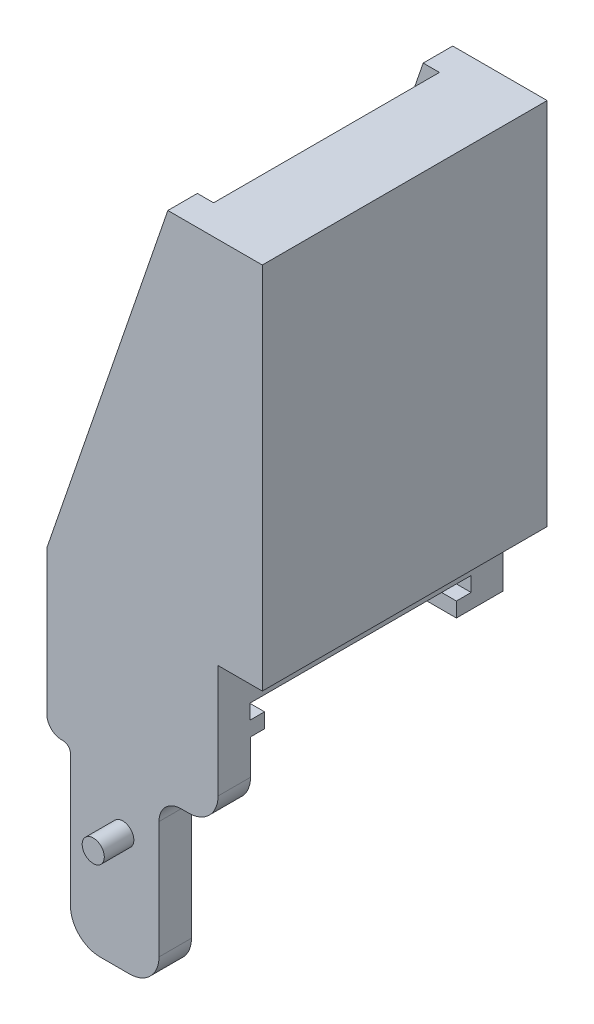
ISO-10303-21;
HEADER;
FILE_DESCRIPTION(('STEP AP214'),'2;1');
FILE_NAME('part.step','',(''),(''),'','','');
FILE_SCHEMA(('AUTOMOTIVE_DESIGN { 1 0 10303 214 1 1 1 1 }'));
ENDSEC;
DATA;
#1=APPLICATION_CONTEXT('core data for automotive mechanical design processes');
#2=APPLICATION_PROTOCOL_DEFINITION('international standard','automotive_design',2000,#1);
#3=PRODUCT_CONTEXT('',#1,'mechanical');
#4=PRODUCT('Part','Part','',(#3));
#5=PRODUCT_RELATED_PRODUCT_CATEGORY('part','',(#4));
#6=PRODUCT_DEFINITION_FORMATION('','',#4);
#7=PRODUCT_DEFINITION_CONTEXT('part definition',#1,'design');
#8=PRODUCT_DEFINITION('design','',#6,#7);
#9=PRODUCT_DEFINITION_SHAPE('','',#8);
#10=(LENGTH_UNIT() NAMED_UNIT(*) SI_UNIT(.MILLI.,.METRE.));
#11=(NAMED_UNIT(*) PLANE_ANGLE_UNIT() SI_UNIT($,.RADIAN.));
#12=(NAMED_UNIT(*) SI_UNIT($,.STERADIAN.) SOLID_ANGLE_UNIT());
#13=UNCERTAINTY_MEASURE_WITH_UNIT(LENGTH_MEASURE(1.E-05),#10,'distance_accuracy_value','');
#14=(GEOMETRIC_REPRESENTATION_CONTEXT(3) GLOBAL_UNCERTAINTY_ASSIGNED_CONTEXT((#13)) GLOBAL_UNIT_ASSIGNED_CONTEXT((#10,
#11,#12)) REPRESENTATION_CONTEXT('',''));
#15=CARTESIAN_POINT('',(0.,0.,0.));
#16=DIRECTION('',(0.,0.,1.));
#17=DIRECTION('',(1.,0.,0.));
#18=AXIS2_PLACEMENT_3D('',#15,#16,#17);
#19=CARTESIAN_POINT('',(5.79999999999999,-9.60695568829756,19.3));
#20=DIRECTION('',(-1.,0.,0.));
#21=DIRECTION('',(0.,0.,1.));
#22=AXIS2_PLACEMENT_3D('',#19,#20,#21);
#23=PLANE('',#22);
#24=DIRECTION('',(0.,0.,-1.));
#25=VECTOR('',#24,1.);
#26=CARTESIAN_POINT('',(5.79999999999999,-1.95,19.3));
#27=LINE('',#26,#25);
#28=CARTESIAN_POINT('',(5.79999999999999,-1.95,19.3));
#29=VERTEX_POINT('',#28);
#30=CARTESIAN_POINT('',(5.79999999999999,-1.95,0.));
#31=VERTEX_POINT('',#30);
#32=EDGE_CURVE('E47',#29,#31,#27,.T.);
#33=ORIENTED_EDGE('',*,*,#32,.F.);
#34=DIRECTION('',(0.,1.,0.));
#35=VECTOR('',#34,1.);
#36=CARTESIAN_POINT('',(5.79999999999999,-9.60695568829756,19.3));
#37=LINE('',#36,#35);
#38=CARTESIAN_POINT('',(5.79999999999999,-9.60695568829756,19.3));
#39=VERTEX_POINT('',#38);
#40=EDGE_CURVE('E263',#39,#29,#37,.T.);
#41=ORIENTED_EDGE('',*,*,#40,.F.);
#42=DIRECTION('',(0.,0.,-1.));
#43=VECTOR('',#42,1.);
#44=CARTESIAN_POINT('',(5.79999999999999,-9.60695568829756,19.3));
#45=LINE('',#44,#43);
#46=CARTESIAN_POINT('',(5.79999999999999,-9.60695568829757,17.1));
#47=VERTEX_POINT('',#46);
#48=EDGE_CURVE('E492',#39,#47,#45,.T.);
#49=ORIENTED_EDGE('',*,*,#48,.T.);
#50=DIRECTION('',(0.,1.,0.));
#51=VECTOR('',#50,1.);
#52=CARTESIAN_POINT('',(5.79999999999999,-9.60695568829756,17.1));
#53=LINE('',#52,#51);
#54=CARTESIAN_POINT('',(5.79999999999999,-7.239890456594,17.1));
#55=VERTEX_POINT('',#54);
#56=EDGE_CURVE('E353',#47,#55,#53,.T.);
#57=ORIENTED_EDGE('',*,*,#56,.T.);
#58=DIRECTION('',(0.,0.,-1.));
#59=VECTOR('',#58,1.);
#60=CARTESIAN_POINT('',(5.79999999999999,-7.239890456594,19.3));
#61=LINE('',#60,#59);
#62=CARTESIAN_POINT('',(5.79999999999999,-7.239890456594,16.15));
#63=VERTEX_POINT('',#62);
#64=EDGE_CURVE('E371',#55,#63,#61,.T.);
#65=ORIENTED_EDGE('',*,*,#64,.T.);
#66=DIRECTION('',(0.,1.,0.));
#67=VECTOR('',#66,1.);
#68=CARTESIAN_POINT('',(5.79999999999999,-9.60695568829756,16.15));
#69=LINE('',#68,#67);
#70=CARTESIAN_POINT('',(5.79999999999999,-6.239890456594,16.15));
#71=VERTEX_POINT('',#70);
#72=EDGE_CURVE('E374',#63,#71,#69,.T.);
#73=ORIENTED_EDGE('',*,*,#72,.T.);
#74=DIRECTION('',(0.,0.,1.));
#75=VECTOR('',#74,1.);
#76=CARTESIAN_POINT('',(5.79999999999999,-6.239890456594,19.3));
#77=LINE('',#76,#75);
#78=CARTESIAN_POINT('',(5.79999999999999,-6.239890456594,17.15));
#79=VERTEX_POINT('',#78);
#80=EDGE_CURVE('E377',#71,#79,#77,.T.);
#81=ORIENTED_EDGE('',*,*,#80,.T.);
#82=DIRECTION('',(0.,1.,0.));
#83=VECTOR('',#82,1.);
#84=CARTESIAN_POINT('',(5.79999999999999,-9.60695568829756,17.15));
#85=LINE('',#84,#83);
#86=CARTESIAN_POINT('',(5.79999999999999,-5.239890456594,17.15));
#87=VERTEX_POINT('',#86);
#88=EDGE_CURVE('E356',#79,#87,#85,.T.);
#89=ORIENTED_EDGE('',*,*,#88,.T.);
#90=DIRECTION('',(0.,0.,-1.));
#91=VECTOR('',#90,1.);
#92=CARTESIAN_POINT('',(5.79999999999999,-5.239890456594,19.3));
#93=LINE('',#92,#91);
#94=CARTESIAN_POINT('',(5.79999999999999,-5.239890456594,2.15));
#95=VERTEX_POINT('',#94);
#96=EDGE_CURVE('E359',#87,#95,#93,.T.);
#97=ORIENTED_EDGE('',*,*,#96,.T.);
#98=DIRECTION('',(0.,-1.,0.));
#99=VECTOR('',#98,1.);
#100=CARTESIAN_POINT('',(5.79999999999999,-9.60695568829756,2.15));
#101=LINE('',#100,#99);
#102=CARTESIAN_POINT('',(5.79999999999999,-6.239890456594,2.15));
#103=VERTEX_POINT('',#102);
#104=EDGE_CURVE('E362',#95,#103,#101,.T.);
#105=ORIENTED_EDGE('',*,*,#104,.T.);
#106=DIRECTION('',(0.,0.,1.));
#107=VECTOR('',#106,1.);
#108=CARTESIAN_POINT('',(5.79999999999999,-6.239890456594,19.3));
#109=LINE('',#108,#107);
#110=CARTESIAN_POINT('',(5.79999999999999,-6.239890456594,3.15));
#111=VERTEX_POINT('',#110);
#112=EDGE_CURVE('E365',#103,#111,#109,.T.);
#113=ORIENTED_EDGE('',*,*,#112,.T.);
#114=DIRECTION('',(0.,-1.,0.));
#115=VECTOR('',#114,1.);
#116=CARTESIAN_POINT('',(5.79999999999999,-9.60695568829756,3.15));
#117=LINE('',#116,#115);
#118=CARTESIAN_POINT('',(5.79999999999999,-7.239890456594,3.15));
#119=VERTEX_POINT('',#118);
#120=EDGE_CURVE('E368',#111,#119,#117,.T.);
#121=ORIENTED_EDGE('',*,*,#120,.T.);
#122=DIRECTION('',(0.,0.,-1.));
#123=VECTOR('',#122,1.);
#124=CARTESIAN_POINT('',(5.79999999999999,-7.239890456594,19.3));
#125=LINE('',#124,#123);
#126=CARTESIAN_POINT('',(5.79999999999999,-7.239890456594,0.));
#127=VERTEX_POINT('',#126);
#128=EDGE_CURVE('E306',#119,#127,#125,.T.);
#129=ORIENTED_EDGE('',*,*,#128,.T.);
#130=DIRECTION('',(0.,1.,0.));
#131=VECTOR('',#130,1.);
#132=CARTESIAN_POINT('',(5.79999999999999,-9.60695568829756,0.));
#133=LINE('',#132,#131);
#134=EDGE_CURVE('E52',#127,#31,#133,.T.);
#135=ORIENTED_EDGE('',*,*,#134,.T.);
#136=EDGE_LOOP('',(#33,#41,#49,#57,#65,#73,#81,#89,#97,#105,#113,#121,#129,#135));
#137=FACE_BOUND('',#136,.T.);
#138=ADVANCED_FACE('F32',(#137),#23,.F.);
#139=CARTESIAN_POINT('',(3.79999999999999,-9.60695568829757,19.3));
#140=DIRECTION('',(0.,0.,1.));
#141=DIRECTION('',(1.,0.,0.));
#142=AXIS2_PLACEMENT_3D('',#139,#140,#141);
#143=PLANE('',#142);
#144=CARTESIAN_POINT('',(3.79999999999999,-9.60695568829757,19.3));
#145=DIRECTION('',(0.,0.,1.));
#146=DIRECTION('',(1.,0.,0.));
#147=AXIS2_PLACEMENT_3D('',#144,#145,#146);
#148=CIRCLE('',#147,2.);
#149=CARTESIAN_POINT('',(3.79999999999998,-11.6069556882976,19.3));
#150=VERTEX_POINT('',#149);
#151=EDGE_CURVE('E412',#150,#39,#148,.T.);
#152=ORIENTED_EDGE('',*,*,#151,.T.);
#153=ORIENTED_EDGE('',*,*,#40,.T.);
#154=DIRECTION('',(-1.,0.,0.));
#155=VECTOR('',#154,1.);
#156=CARTESIAN_POINT('',(8.79999999999999,-1.95,19.3));
#157=LINE('',#156,#155);
#158=CARTESIAN_POINT('',(8.79999999999999,-1.95,19.3));
#159=VERTEX_POINT('',#158);
#160=EDGE_CURVE('E244',#159,#29,#157,.T.);
#161=ORIENTED_EDGE('',*,*,#160,.F.);
#162=DIRECTION('',(0.,-1.,0.));
#163=VECTOR('',#162,1.);
#164=CARTESIAN_POINT('',(8.79999999999999,23.05,19.3));
#165=LINE('',#164,#163);
#166=CARTESIAN_POINT('',(8.79999999999999,23.05,19.3));
#167=VERTEX_POINT('',#166);
#168=EDGE_CURVE('E251',#167,#159,#165,.T.);
#169=ORIENTED_EDGE('',*,*,#168,.F.);
#170=DIRECTION('',(-1.,0.,0.));
#171=VECTOR('',#170,1.);
#172=CARTESIAN_POINT('',(5.79999999999999,23.05,19.3));
#173=LINE('',#172,#171);
#174=CARTESIAN_POINT('',(2.4,23.05,19.3));
#175=VERTEX_POINT('',#174);
#176=EDGE_CURVE('E416',#167,#175,#173,.T.);
#177=ORIENTED_EDGE('',*,*,#176,.T.);
#178=DIRECTION('',(-0.324526679920324,-0.945876542694601,0.));
#179=VECTOR('',#178,1.);
#180=CARTESIAN_POINT('',(2.4,23.05,19.3));
#181=LINE('',#180,#179);
#182=CARTESIAN_POINT('',(-5.80000000000001,-0.850000000000011,19.3));
#183=VERTEX_POINT('',#182);
#184=EDGE_CURVE('E418',#175,#183,#181,.T.);
#185=ORIENTED_EDGE('',*,*,#184,.T.);
#186=DIRECTION('',(0.,-1.,0.));
#187=VECTOR('',#186,1.);
#188=CARTESIAN_POINT('',(-5.80000000000003,-10.609737320816,19.3));
#189=LINE('',#188,#187);
#190=CARTESIAN_POINT('',(-5.80000000000002,-10.609737320816,19.3));
#191=VERTEX_POINT('',#190);
#192=EDGE_CURVE('E420',#183,#191,#189,.T.);
#193=ORIENTED_EDGE('',*,*,#192,.T.);
#194=CARTESIAN_POINT('',(-4.80000000000001,-10.609737320816,19.3));
#195=DIRECTION('',(0.,0.,1.));
#196=DIRECTION('',(-1.,0.,0.));
#197=AXIS2_PLACEMENT_3D('',#194,#195,#196);
#198=CIRCLE('',#197,1.00000000000001);
#199=CARTESIAN_POINT('',(-4.79534594572987,-11.6097264906468,19.3));
#200=VERTEX_POINT('',#199);
#201=EDGE_CURVE('E422',#191,#200,#198,.T.);
#202=ORIENTED_EDGE('',*,*,#201,.T.);
#203=DIRECTION('',(0.999989169830779,0.00465405427015842,0.));
#204=VECTOR('',#203,1.);
#205=CARTESIAN_POINT('',(-4.70232702713509,-11.6092935708629,19.3));
#206=LINE('',#205,#204);
#207=CARTESIAN_POINT('',(-4.70232702713509,-11.6092935708629,19.3));
#208=VERTEX_POINT('',#207);
#209=EDGE_CURVE('E424',#200,#208,#206,.T.);
#210=ORIENTED_EDGE('',*,*,#209,.T.);
#211=CARTESIAN_POINT('',(-4.70000000000001,-12.1092881557783,19.3));
#212=DIRECTION('',(0.,0.,-1.));
#213=DIRECTION('',(1.,0.,0.));
#214=AXIS2_PLACEMENT_3D('',#211,#212,#213);
#215=CIRCLE('',#214,0.499999999999999);
#216=CARTESIAN_POINT('',(-4.20000000000001,-12.1092881557783,19.3));
#217=VERTEX_POINT('',#216);
#218=EDGE_CURVE('E426',#208,#217,#215,.T.);
#219=ORIENTED_EDGE('',*,*,#218,.T.);
#220=DIRECTION('',(0.,-1.,0.));
#221=VECTOR('',#220,1.);
#222=CARTESIAN_POINT('',(-4.20000000000001,-21.05,19.3));
#223=LINE('',#222,#221);
#224=CARTESIAN_POINT('',(-4.20000000000001,-21.05,19.3));
#225=VERTEX_POINT('',#224);
#226=EDGE_CURVE('E428',#217,#225,#223,.T.);
#227=ORIENTED_EDGE('',*,*,#226,.T.);
#228=CARTESIAN_POINT('',(-2.20000000000001,-21.05,19.3));
#229=DIRECTION('',(0.,0.,1.));
#230=DIRECTION('',(-1.,0.,0.));
#231=AXIS2_PLACEMENT_3D('',#228,#229,#230);
#232=CIRCLE('',#231,2.);
#233=CARTESIAN_POINT('',(-2.19999999999999,-23.05,19.3));
#234=VERTEX_POINT('',#233);
#235=EDGE_CURVE('E430',#225,#234,#232,.T.);
#236=ORIENTED_EDGE('',*,*,#235,.T.);
#237=DIRECTION('',(1.,0.,0.));
#238=VECTOR('',#237,1.);
#239=CARTESIAN_POINT('',(-0.200000000000023,-23.05,19.3));
#240=LINE('',#239,#238);
#241=CARTESIAN_POINT('',(-0.200000000000022,-23.05,19.3));
#242=VERTEX_POINT('',#241);
#243=EDGE_CURVE('E432',#234,#242,#240,.T.);
#244=ORIENTED_EDGE('',*,*,#243,.T.);
#245=CARTESIAN_POINT('',(-0.200000000000008,-21.05,19.3));
#246=DIRECTION('',(0.,0.,1.));
#247=DIRECTION('',(-1.,0.,0.));
#248=AXIS2_PLACEMENT_3D('',#245,#246,#247);
#249=CIRCLE('',#248,2.);
#250=CARTESIAN_POINT('',(1.79999999999999,-21.05,19.3));
#251=VERTEX_POINT('',#250);
#252=EDGE_CURVE('E434',#242,#251,#249,.T.);
#253=ORIENTED_EDGE('',*,*,#252,.T.);
#254=DIRECTION('',(0.,1.,0.));
#255=VECTOR('',#254,1.);
#256=CARTESIAN_POINT('',(1.79999999999999,-13.1069556882976,19.3));
#257=LINE('',#256,#255);
#258=CARTESIAN_POINT('',(1.79999999999999,-13.1069556882976,19.3));
#259=VERTEX_POINT('',#258);
#260=EDGE_CURVE('E436',#251,#259,#257,.T.);
#261=ORIENTED_EDGE('',*,*,#260,.T.);
#262=CARTESIAN_POINT('',(3.29999999999999,-13.1069556882976,19.3));
#263=DIRECTION('',(0.,0.,-1.));
#264=DIRECTION('',(-1.,0.,0.));
#265=AXIS2_PLACEMENT_3D('',#262,#263,#264);
#266=CIRCLE('',#265,1.5);
#267=CARTESIAN_POINT('',(3.3,-11.6069556882976,19.3));
#268=VERTEX_POINT('',#267);
#269=EDGE_CURVE('E438',#259,#268,#266,.T.);
#270=ORIENTED_EDGE('',*,*,#269,.T.);
#271=DIRECTION('',(1.,0.,0.));
#272=VECTOR('',#271,1.);
#273=CARTESIAN_POINT('',(3.3,-11.6069556882976,19.3));
#274=LINE('',#273,#272);
#275=EDGE_CURVE('E440',#268,#150,#274,.T.);
#276=ORIENTED_EDGE('',*,*,#275,.T.);
#277=EDGE_LOOP('',(#152,#153,#161,#169,#177,#185,#193,#202,#210,#219,#227,#236,#244,#253,#261,
#270,#276));
#278=FACE_BOUND('',#277,.T.);
#279=CARTESIAN_POINT('',(-0.655214383275673,-15.0462014414849,19.3));
#280=DIRECTION('',(0.,0.,1.));
#281=DIRECTION('',(1.,0.,0.));
#282=AXIS2_PLACEMENT_3D('',#279,#280,#281);
#283=CIRCLE('',#282,0.750000000000001);
#284=CARTESIAN_POINT('',(0.0947856167243282,-15.0462014414849,19.3));
#285=VERTEX_POINT('',#284);
#286=EDGE_CURVE('E264',#285,#285,#283,.T.);
#287=ORIENTED_EDGE('',*,*,#286,.F.);
#288=EDGE_LOOP('',(#287));
#289=FACE_BOUND('',#288,.T.);
#290=ADVANCED_FACE('F261',(#278,#289),#143,.T.);
#291=CARTESIAN_POINT('',(2.4,23.05,19.3));
#292=DIRECTION('',(0.945876542694601,-0.324526679920324,0.));
#293=DIRECTION('',(0.324526679920324,0.945876542694601,0.));
#294=AXIS2_PLACEMENT_3D('',#291,#292,#293);
#295=PLANE('',#294);
#296=DIRECTION('',(0.,0.,-1.));
#297=VECTOR('',#296,1.);
#298=CARTESIAN_POINT('',(-5.80000000000001,-0.850000000000011,19.3));
#299=LINE('',#298,#297);
#300=CARTESIAN_POINT('',(-5.8,-0.850000000000011,2.));
#301=VERTEX_POINT('',#300);
#302=CARTESIAN_POINT('',(-5.80000000000001,-0.850000000000011,0.));
#303=VERTEX_POINT('',#302);
#304=EDGE_CURVE('E484',#301,#303,#299,.T.);
#305=ORIENTED_EDGE('',*,*,#304,.F.);
#306=DIRECTION('',(0.324526679920324,0.945876542694601,0.));
#307=VECTOR('',#306,1.);
#308=CARTESIAN_POINT('',(2.4,23.05,2.));
#309=LINE('',#308,#307);
#310=CARTESIAN_POINT('',(2.4,23.05,2.));
#311=VERTEX_POINT('',#310);
#312=EDGE_CURVE('E409',#301,#311,#309,.T.);
#313=ORIENTED_EDGE('',*,*,#312,.T.);
#314=DIRECTION('',(0.,0.,-1.));
#315=VECTOR('',#314,1.);
#316=CARTESIAN_POINT('',(2.4,23.05,19.3));
#317=LINE('',#316,#315);
#318=CARTESIAN_POINT('',(2.4,23.05,0.));
#319=VERTEX_POINT('',#318);
#320=EDGE_CURVE('E488',#311,#319,#317,.T.);
#321=ORIENTED_EDGE('',*,*,#320,.T.);
#322=DIRECTION('',(-0.324526679920324,-0.945876542694601,0.));
#323=VECTOR('',#322,1.);
#324=CARTESIAN_POINT('',(2.4,23.05,0.));
#325=LINE('',#324,#323);
#326=EDGE_CURVE('E447',#319,#303,#325,.T.);
#327=ORIENTED_EDGE('',*,*,#326,.T.);
#328=EDGE_LOOP('',(#305,#313,#321,#327));
#329=FACE_BOUND('',#328,.T.);
#330=ADVANCED_FACE('F511',(#329),#295,.F.);
#331=CARTESIAN_POINT('',(3.79999999999999,-9.60695568829757,19.3));
#332=DIRECTION('',(0.,0.,-1.));
#333=DIRECTION('',(-1.,0.,0.));
#334=AXIS2_PLACEMENT_3D('',#331,#332,#333);
#335=CYLINDRICAL_SURFACE('',#334,2.);
#336=DIRECTION('',(0.,0.,-1.));
#337=VECTOR('',#336,1.);
#338=CARTESIAN_POINT('',(3.79999999999998,-11.6069556882976,19.3));
#339=LINE('',#338,#337);
#340=CARTESIAN_POINT('',(3.79999999999998,-11.6069556882976,17.1));
#341=VERTEX_POINT('',#340);
#342=EDGE_CURVE('E442',#150,#341,#339,.T.);
#343=ORIENTED_EDGE('',*,*,#342,.T.);
#344=CARTESIAN_POINT('',(3.79999999999999,-9.60695568829757,17.1));
#345=DIRECTION('',(0.,0.,1.));
#346=DIRECTION('',(1.,0.,0.));
#347=AXIS2_PLACEMENT_3D('',#344,#345,#346);
#348=CIRCLE('',#347,2.);
#349=EDGE_CURVE('E350',#341,#47,#348,.T.);
#350=ORIENTED_EDGE('',*,*,#349,.T.);
#351=ORIENTED_EDGE('',*,*,#48,.F.);
#352=ORIENTED_EDGE('',*,*,#151,.F.);
#353=EDGE_LOOP('',(#343,#350,#351,#352));
#354=FACE_BOUND('',#353,.T.);
#355=ADVANCED_FACE('F34',(#354),#335,.T.);
#356=CARTESIAN_POINT('',(5.79999999999999,23.05,19.3));
#357=DIRECTION('',(0.,-1.,0.));
#358=DIRECTION('',(1.,0.,0.));
#359=AXIS2_PLACEMENT_3D('',#356,#357,#358);
#360=PLANE('',#359);
#361=ORIENTED_EDGE('',*,*,#320,.F.);
#362=DIRECTION('',(-1.,0.,0.));
#363=VECTOR('',#362,1.);
#364=CARTESIAN_POINT('',(3.5,23.05,2.));
#365=LINE('',#364,#363);
#366=CARTESIAN_POINT('',(3.5,23.05,2.));
#367=VERTEX_POINT('',#366);
#368=EDGE_CURVE('E400',#367,#311,#365,.T.);
#369=ORIENTED_EDGE('',*,*,#368,.F.);
#370=DIRECTION('',(0.,0.,-1.));
#371=VECTOR('',#370,1.);
#372=CARTESIAN_POINT('',(3.5,23.05,17.3));
#373=LINE('',#372,#371);
#374=CARTESIAN_POINT('',(3.5,23.05,17.3));
#375=VERTEX_POINT('',#374);
#376=EDGE_CURVE('E388',#375,#367,#373,.T.);
#377=ORIENTED_EDGE('',*,*,#376,.F.);
#378=DIRECTION('',(-1.,0.,0.));
#379=VECTOR('',#378,1.);
#380=CARTESIAN_POINT('',(3.5,23.05,17.3));
#381=LINE('',#380,#379);
#382=CARTESIAN_POINT('',(2.4,23.05,17.3));
#383=VERTEX_POINT('',#382);
#384=EDGE_CURVE('E402',#375,#383,#381,.T.);
#385=ORIENTED_EDGE('',*,*,#384,.T.);
#386=EDGE_CURVE('E489',#175,#383,#317,.T.);
#387=ORIENTED_EDGE('',*,*,#386,.F.);
#388=ORIENTED_EDGE('',*,*,#176,.F.);
#389=DIRECTION('',(0.,0.,1.));
#390=VECTOR('',#389,1.);
#391=CARTESIAN_POINT('',(8.79999999999999,23.05,19.3));
#392=LINE('',#391,#390);
#393=CARTESIAN_POINT('',(8.79999999999999,23.05,0.));
#394=VERTEX_POINT('',#393);
#395=EDGE_CURVE('E257',#394,#167,#392,.T.);
#396=ORIENTED_EDGE('',*,*,#395,.F.);
#397=DIRECTION('',(-1.,0.,0.));
#398=VECTOR('',#397,1.);
#399=CARTESIAN_POINT('',(5.79999999999999,23.05,0.));
#400=LINE('',#399,#398);
#401=EDGE_CURVE('E444',#394,#319,#400,.T.);
#402=ORIENTED_EDGE('',*,*,#401,.T.);
#403=EDGE_LOOP('',(#361,#369,#377,#385,#387,#388,#396,#402));
#404=FACE_BOUND('',#403,.T.);
#405=ADVANCED_FACE('F515',(#404),#360,.F.);
#406=ORIENTED_EDGE('',*,*,#386,.T.);
#407=DIRECTION('',(-0.324526679920324,-0.945876542694601,0.));
#408=VECTOR('',#407,1.);
#409=CARTESIAN_POINT('',(2.4,23.05,17.3));
#410=LINE('',#409,#408);
#411=CARTESIAN_POINT('',(-5.8,-0.850000000000011,17.3));
#412=VERTEX_POINT('',#411);
#413=EDGE_CURVE('E399',#383,#412,#410,.T.);
#414=ORIENTED_EDGE('',*,*,#413,.T.);
#415=EDGE_CURVE('E485',#183,#412,#299,.T.);
#416=ORIENTED_EDGE('',*,*,#415,.F.);
#417=ORIENTED_EDGE('',*,*,#184,.F.);
#418=EDGE_LOOP('',(#406,#414,#416,#417));
#419=FACE_BOUND('',#418,.T.);
#420=ADVANCED_FACE('F523',(#419),#295,.F.);
#421=CARTESIAN_POINT('',(-5.80000000000003,-10.609737320816,19.3));
#422=DIRECTION('',(1.,0.,0.));
#423=DIRECTION('',(0.,1.,0.));
#424=AXIS2_PLACEMENT_3D('',#421,#422,#423);
#425=PLANE('',#424);
#426=DIRECTION('',(0.,0.,-1.));
#427=VECTOR('',#426,1.);
#428=CARTESIAN_POINT('',(-5.80000000000002,-7.23989045659397,16.15));
#429=LINE('',#428,#427);
#430=CARTESIAN_POINT('',(-5.80000000000002,-7.23989045659397,17.1));
#431=VERTEX_POINT('',#430);
#432=CARTESIAN_POINT('',(-5.80000000000002,-7.23989045659397,16.15));
#433=VERTEX_POINT('',#432);
#434=EDGE_CURVE('E297',#431,#433,#429,.T.);
#435=ORIENTED_EDGE('',*,*,#434,.F.);
#436=DIRECTION('',(0.,1.,0.));
#437=VECTOR('',#436,1.);
#438=CARTESIAN_POINT('',(-5.80000000000002,-7.23989045659397,17.1));
#439=LINE('',#438,#437);
#440=CARTESIAN_POINT('',(-5.80000000000003,-10.609737320816,17.1));
#441=VERTEX_POINT('',#440);
#442=EDGE_CURVE('E294',#441,#431,#439,.T.);
#443=ORIENTED_EDGE('',*,*,#442,.F.);
#444=DIRECTION('',(0.,0.,-1.));
#445=VECTOR('',#444,1.);
#446=CARTESIAN_POINT('',(-5.80000000000002,-10.609737320816,19.3));
#447=LINE('',#446,#445);
#448=EDGE_CURVE('E481',#191,#441,#447,.T.);
#449=ORIENTED_EDGE('',*,*,#448,.F.);
#450=ORIENTED_EDGE('',*,*,#192,.F.);
#451=ORIENTED_EDGE('',*,*,#415,.T.);
#452=DIRECTION('',(0.,1.,0.));
#453=VECTOR('',#452,1.);
#454=CARTESIAN_POINT('',(-5.8,-3.25,17.3));
#455=LINE('',#454,#453);
#456=CARTESIAN_POINT('',(-5.80000000000001,-3.25,17.3));
#457=VERTEX_POINT('',#456);
#458=EDGE_CURVE('E385',#457,#412,#455,.T.);
#459=ORIENTED_EDGE('',*,*,#458,.F.);
#460=DIRECTION('',(0.,0.,1.));
#461=VECTOR('',#460,1.);
#462=CARTESIAN_POINT('',(-5.8,-3.25,2.));
#463=LINE('',#462,#461);
#464=CARTESIAN_POINT('',(-5.8,-3.25,2.));
#465=VERTEX_POINT('',#464);
#466=EDGE_CURVE('E380',#465,#457,#463,.T.);
#467=ORIENTED_EDGE('',*,*,#466,.F.);
#468=DIRECTION('',(0.,1.,0.));
#469=VECTOR('',#468,1.);
#470=CARTESIAN_POINT('',(-5.80000000000003,-10.609737320816,2.));
#471=LINE('',#470,#469);
#472=EDGE_CURVE('E495',#465,#301,#471,.T.);
#473=ORIENTED_EDGE('',*,*,#472,.T.);
#474=ORIENTED_EDGE('',*,*,#304,.T.);
#475=DIRECTION('',(0.,-1.,0.));
#476=VECTOR('',#475,1.);
#477=CARTESIAN_POINT('',(-5.80000000000003,-10.609737320816,0.));
#478=LINE('',#477,#476);
#479=CARTESIAN_POINT('',(-5.80000000000002,-7.23989045659397,0.));
#480=VERTEX_POINT('',#479);
#481=EDGE_CURVE('E414',#303,#480,#478,.T.);
#482=ORIENTED_EDGE('',*,*,#481,.T.);
#483=DIRECTION('',(0.,0.,-1.));
#484=VECTOR('',#483,1.);
#485=CARTESIAN_POINT('',(-5.80000000000002,-7.23989045659397,3.15));
#486=LINE('',#485,#484);
#487=CARTESIAN_POINT('',(-5.80000000000002,-7.23989045659397,3.15));
#488=VERTEX_POINT('',#487);
#489=EDGE_CURVE('E292',#488,#480,#486,.T.);
#490=ORIENTED_EDGE('',*,*,#489,.F.);
#491=DIRECTION('',(0.,-1.,0.));
#492=VECTOR('',#491,1.);
#493=CARTESIAN_POINT('',(-5.80000000000002,-6.23989045659397,3.15));
#494=LINE('',#493,#492);
#495=CARTESIAN_POINT('',(-5.80000000000002,-6.23989045659397,3.15));
#496=VERTEX_POINT('',#495);
#497=EDGE_CURVE('E289',#496,#488,#494,.T.);
#498=ORIENTED_EDGE('',*,*,#497,.F.);
#499=DIRECTION('',(0.,0.,1.));
#500=VECTOR('',#499,1.);
#501=CARTESIAN_POINT('',(-5.80000000000002,-6.23989045659397,2.15));
#502=LINE('',#501,#500);
#503=CARTESIAN_POINT('',(-5.80000000000002,-6.23989045659397,2.15));
#504=VERTEX_POINT('',#503);
#505=EDGE_CURVE('E286',#504,#496,#502,.T.);
#506=ORIENTED_EDGE('',*,*,#505,.F.);
#507=DIRECTION('',(0.,-1.,0.));
#508=VECTOR('',#507,1.);
#509=CARTESIAN_POINT('',(-5.80000000000002,-5.23989045659397,2.15));
#510=LINE('',#509,#508);
#511=CARTESIAN_POINT('',(-5.80000000000002,-5.23989045659397,2.15));
#512=VERTEX_POINT('',#511);
#513=EDGE_CURVE('E283',#512,#504,#510,.T.);
#514=ORIENTED_EDGE('',*,*,#513,.F.);
#515=DIRECTION('',(0.,0.,-1.));
#516=VECTOR('',#515,1.);
#517=CARTESIAN_POINT('',(-5.80000000000002,-5.23989045659397,17.15));
#518=LINE('',#517,#516);
#519=CARTESIAN_POINT('',(-5.80000000000002,-5.23989045659397,17.15));
#520=VERTEX_POINT('',#519);
#521=EDGE_CURVE('E280',#520,#512,#518,.T.);
#522=ORIENTED_EDGE('',*,*,#521,.F.);
#523=DIRECTION('',(0.,1.,0.));
#524=VECTOR('',#523,1.);
#525=CARTESIAN_POINT('',(-5.80000000000002,-5.23989045659397,17.15));
#526=LINE('',#525,#524);
#527=CARTESIAN_POINT('',(-5.80000000000002,-6.23989045659397,17.15));
#528=VERTEX_POINT('',#527);
#529=EDGE_CURVE('E277',#528,#520,#526,.T.);
#530=ORIENTED_EDGE('',*,*,#529,.F.);
#531=DIRECTION('',(0.,0.,1.));
#532=VECTOR('',#531,1.);
#533=CARTESIAN_POINT('',(-5.80000000000002,-6.23989045659397,17.15));
#534=LINE('',#533,#532);
#535=CARTESIAN_POINT('',(-5.80000000000002,-6.23989045659397,16.15));
#536=VERTEX_POINT('',#535);
#537=EDGE_CURVE('E273',#536,#528,#534,.T.);
#538=ORIENTED_EDGE('',*,*,#537,.F.);
#539=DIRECTION('',(0.,1.,0.));
#540=VECTOR('',#539,1.);
#541=CARTESIAN_POINT('',(-5.80000000000002,-6.23989045659397,16.15));
#542=LINE('',#541,#540);
#543=EDGE_CURVE('E300',#433,#536,#542,.T.);
#544=ORIENTED_EDGE('',*,*,#543,.F.);
#545=EDGE_LOOP('',(#435,#443,#449,#450,#451,#459,#467,#473,#474,#482,#490,#498,#506,#514,#522,
#530,#538,#544));
#546=FACE_BOUND('',#545,.T.);
#547=ADVANCED_FACE('F506',(#546),#425,.F.);
#548=CARTESIAN_POINT('',(-4.80000000000001,-10.609737320816,19.3));
#549=DIRECTION('',(0.,0.,-1.));
#550=DIRECTION('',(-1.,0.,0.));
#551=AXIS2_PLACEMENT_3D('',#548,#549,#550);
#552=CYLINDRICAL_SURFACE('',#551,1.00000000000001);
#553=ORIENTED_EDGE('',*,*,#448,.T.);
#554=CARTESIAN_POINT('',(-4.80000000000001,-10.609737320816,17.1));
#555=DIRECTION('',(0.,0.,1.));
#556=DIRECTION('',(1.,0.,0.));
#557=AXIS2_PLACEMENT_3D('',#554,#555,#556);
#558=CIRCLE('',#557,1.00000000000001);
#559=CARTESIAN_POINT('',(-4.79534594572987,-11.6097264906468,17.1));
#560=VERTEX_POINT('',#559);
#561=EDGE_CURVE('E347',#441,#560,#558,.T.);
#562=ORIENTED_EDGE('',*,*,#561,.T.);
#563=DIRECTION('',(0.,0.,-1.));
#564=VECTOR('',#563,1.);
#565=CARTESIAN_POINT('',(-4.79534594572987,-11.6097264906468,19.3));
#566=LINE('',#565,#564);
#567=EDGE_CURVE('E478',#200,#560,#566,.T.);
#568=ORIENTED_EDGE('',*,*,#567,.F.);
#569=ORIENTED_EDGE('',*,*,#201,.F.);
#570=EDGE_LOOP('',(#553,#562,#568,#569));
#571=FACE_BOUND('',#570,.T.);
#572=ADVANCED_FACE('F529',(#571),#552,.T.);
#573=CARTESIAN_POINT('',(-4.70232702713509,-11.6092935708629,19.3));
#574=DIRECTION('',(-0.00465405427015842,0.999989169830779,0.));
#575=DIRECTION('',(-0.999989169830779,-0.00465405427015842,0.));
#576=AXIS2_PLACEMENT_3D('',#573,#574,#575);
#577=PLANE('',#576);
#578=ORIENTED_EDGE('',*,*,#567,.T.);
#579=DIRECTION('',(0.999989169830779,0.00465405427015842,0.));
#580=VECTOR('',#579,1.);
#581=CARTESIAN_POINT('',(-4.70232702713509,-11.6092935708629,17.1));
#582=LINE('',#581,#580);
#583=CARTESIAN_POINT('',(-4.70232702713509,-11.6092935708629,17.1));
#584=VERTEX_POINT('',#583);
#585=EDGE_CURVE('E344',#560,#584,#582,.T.);
#586=ORIENTED_EDGE('',*,*,#585,.T.);
#587=DIRECTION('',(0.,0.,-1.));
#588=VECTOR('',#587,1.);
#589=CARTESIAN_POINT('',(-4.70232702713509,-11.6092935708629,19.3));
#590=LINE('',#589,#588);
#591=EDGE_CURVE('E475',#208,#584,#590,.T.);
#592=ORIENTED_EDGE('',*,*,#591,.F.);
#593=ORIENTED_EDGE('',*,*,#209,.F.);
#594=EDGE_LOOP('',(#578,#586,#592,#593));
#595=FACE_BOUND('',#594,.T.);
#596=ADVANCED_FACE('F535',(#595),#577,.F.);
#597=CARTESIAN_POINT('',(-4.70000000000001,-12.1092881557783,19.3));
#598=DIRECTION('',(0.,0.,-1.));
#599=DIRECTION('',(-1.,0.,0.));
#600=AXIS2_PLACEMENT_3D('',#597,#598,#599);
#601=CYLINDRICAL_SURFACE('',#600,0.499999999999999);
#602=ORIENTED_EDGE('',*,*,#591,.T.);
#603=CARTESIAN_POINT('',(-4.70000000000001,-12.1092881557783,17.1));
#604=DIRECTION('',(0.,0.,1.));
#605=DIRECTION('',(1.,0.,0.));
#606=AXIS2_PLACEMENT_3D('',#603,#604,#605);
#607=CIRCLE('',#606,0.499999999999999);
#608=CARTESIAN_POINT('',(-4.20000000000001,-12.1092881557783,17.1));
#609=VERTEX_POINT('',#608);
#610=EDGE_CURVE('E341',#584,#609,#607,.F.);
#611=ORIENTED_EDGE('',*,*,#610,.T.);
#612=DIRECTION('',(0.,0.,-1.));
#613=VECTOR('',#612,1.);
#614=CARTESIAN_POINT('',(-4.20000000000001,-12.1092881557783,19.3));
#615=LINE('',#614,#613);
#616=EDGE_CURVE('E472',#217,#609,#615,.T.);
#617=ORIENTED_EDGE('',*,*,#616,.F.);
#618=ORIENTED_EDGE('',*,*,#218,.F.);
#619=EDGE_LOOP('',(#602,#611,#617,#618));
#620=FACE_BOUND('',#619,.T.);
#621=ADVANCED_FACE('F537',(#620),#601,.F.);
#622=CARTESIAN_POINT('',(-4.20000000000001,-21.05,19.3));
#623=DIRECTION('',(1.,0.,0.));
#624=DIRECTION('',(0.,0.,-1.));
#625=AXIS2_PLACEMENT_3D('',#622,#623,#624);
#626=PLANE('',#625);
#627=ORIENTED_EDGE('',*,*,#616,.T.);
#628=DIRECTION('',(0.,-1.,0.));
#629=VECTOR('',#628,1.);
#630=CARTESIAN_POINT('',(-4.20000000000001,-21.05,17.1));
#631=LINE('',#630,#629);
#632=CARTESIAN_POINT('',(-4.20000000000001,-21.05,17.1));
#633=VERTEX_POINT('',#632);
#634=EDGE_CURVE('E338',#609,#633,#631,.T.);
#635=ORIENTED_EDGE('',*,*,#634,.T.);
#636=DIRECTION('',(0.,0.,-1.));
#637=VECTOR('',#636,1.);
#638=CARTESIAN_POINT('',(-4.20000000000001,-21.05,19.3));
#639=LINE('',#638,#637);
#640=EDGE_CURVE('E469',#225,#633,#639,.T.);
#641=ORIENTED_EDGE('',*,*,#640,.F.);
#642=ORIENTED_EDGE('',*,*,#226,.F.);
#643=EDGE_LOOP('',(#627,#635,#641,#642));
#644=FACE_BOUND('',#643,.T.);
#645=ADVANCED_FACE('F541',(#644),#626,.F.);
#646=CARTESIAN_POINT('',(-2.20000000000001,-21.05,19.3));
#647=DIRECTION('',(0.,0.,-1.));
#648=DIRECTION('',(-1.,0.,0.));
#649=AXIS2_PLACEMENT_3D('',#646,#647,#648);
#650=CYLINDRICAL_SURFACE('',#649,2.);
#651=ORIENTED_EDGE('',*,*,#640,.T.);
#652=CARTESIAN_POINT('',(-2.20000000000001,-21.05,17.1));
#653=DIRECTION('',(0.,0.,1.));
#654=DIRECTION('',(1.,0.,0.));
#655=AXIS2_PLACEMENT_3D('',#652,#653,#654);
#656=CIRCLE('',#655,2.);
#657=CARTESIAN_POINT('',(-2.19999999999999,-23.05,17.1));
#658=VERTEX_POINT('',#657);
#659=EDGE_CURVE('E335',#633,#658,#656,.T.);
#660=ORIENTED_EDGE('',*,*,#659,.T.);
#661=DIRECTION('',(0.,0.,-1.));
#662=VECTOR('',#661,1.);
#663=CARTESIAN_POINT('',(-2.19999999999999,-23.05,19.3));
#664=LINE('',#663,#662);
#665=EDGE_CURVE('E466',#234,#658,#664,.T.);
#666=ORIENTED_EDGE('',*,*,#665,.F.);
#667=ORIENTED_EDGE('',*,*,#235,.F.);
#668=EDGE_LOOP('',(#651,#660,#666,#667));
#669=FACE_BOUND('',#668,.T.);
#670=ADVANCED_FACE('F547',(#669),#650,.T.);
#671=CARTESIAN_POINT('',(-0.200000000000023,-23.05,19.3));
#672=DIRECTION('',(0.,1.,0.));
#673=DIRECTION('',(0.,0.,1.));
#674=AXIS2_PLACEMENT_3D('',#671,#672,#673);
#675=PLANE('',#674);
#676=ORIENTED_EDGE('',*,*,#665,.T.);
#677=DIRECTION('',(1.,0.,0.));
#678=VECTOR('',#677,1.);
#679=CARTESIAN_POINT('',(-0.200000000000023,-23.05,17.1));
#680=LINE('',#679,#678);
#681=CARTESIAN_POINT('',(-0.200000000000022,-23.05,17.1));
#682=VERTEX_POINT('',#681);
#683=EDGE_CURVE('E332',#658,#682,#680,.T.);
#684=ORIENTED_EDGE('',*,*,#683,.T.);
#685=DIRECTION('',(0.,0.,-1.));
#686=VECTOR('',#685,1.);
#687=CARTESIAN_POINT('',(-0.200000000000022,-23.05,19.3));
#688=LINE('',#687,#686);
#689=EDGE_CURVE('E463',#242,#682,#688,.T.);
#690=ORIENTED_EDGE('',*,*,#689,.F.);
#691=ORIENTED_EDGE('',*,*,#243,.F.);
#692=EDGE_LOOP('',(#676,#684,#690,#691));
#693=FACE_BOUND('',#692,.T.);
#694=ADVANCED_FACE('F549',(#693),#675,.F.);
#695=CARTESIAN_POINT('',(-0.200000000000008,-21.05,19.3));
#696=DIRECTION('',(0.,0.,-1.));
#697=DIRECTION('',(-1.,0.,0.));
#698=AXIS2_PLACEMENT_3D('',#695,#696,#697);
#699=CYLINDRICAL_SURFACE('',#698,2.);
#700=ORIENTED_EDGE('',*,*,#689,.T.);
#701=CARTESIAN_POINT('',(-0.200000000000008,-21.05,17.1));
#702=DIRECTION('',(0.,0.,1.));
#703=DIRECTION('',(1.,0.,0.));
#704=AXIS2_PLACEMENT_3D('',#701,#702,#703);
#705=CIRCLE('',#704,2.);
#706=CARTESIAN_POINT('',(1.79999999999999,-21.05,17.1));
#707=VERTEX_POINT('',#706);
#708=EDGE_CURVE('E329',#682,#707,#705,.T.);
#709=ORIENTED_EDGE('',*,*,#708,.T.);
#710=DIRECTION('',(0.,0.,-1.));
#711=VECTOR('',#710,1.);
#712=CARTESIAN_POINT('',(1.79999999999999,-21.05,19.3));
#713=LINE('',#712,#711);
#714=EDGE_CURVE('E460',#251,#707,#713,.T.);
#715=ORIENTED_EDGE('',*,*,#714,.F.);
#716=ORIENTED_EDGE('',*,*,#252,.F.);
#717=EDGE_LOOP('',(#700,#709,#715,#716));
#718=FACE_BOUND('',#717,.T.);
#719=ADVANCED_FACE('F553',(#718),#699,.T.);
#720=CARTESIAN_POINT('',(1.79999999999999,-13.1069556882976,19.3));
#721=DIRECTION('',(-1.,0.,0.));
#722=DIRECTION('',(0.,0.,1.));
#723=AXIS2_PLACEMENT_3D('',#720,#721,#722);
#724=PLANE('',#723);
#725=ORIENTED_EDGE('',*,*,#714,.T.);
#726=DIRECTION('',(0.,1.,0.));
#727=VECTOR('',#726,1.);
#728=CARTESIAN_POINT('',(1.79999999999999,-13.1069556882976,17.1));
#729=LINE('',#728,#727);
#730=CARTESIAN_POINT('',(1.79999999999999,-13.1069556882976,17.1));
#731=VERTEX_POINT('',#730);
#732=EDGE_CURVE('E326',#707,#731,#729,.T.);
#733=ORIENTED_EDGE('',*,*,#732,.T.);
#734=DIRECTION('',(0.,0.,-1.));
#735=VECTOR('',#734,1.);
#736=CARTESIAN_POINT('',(1.79999999999999,-13.1069556882976,19.3));
#737=LINE('',#736,#735);
#738=EDGE_CURVE('E457',#259,#731,#737,.T.);
#739=ORIENTED_EDGE('',*,*,#738,.F.);
#740=ORIENTED_EDGE('',*,*,#260,.F.);
#741=EDGE_LOOP('',(#725,#733,#739,#740));
#742=FACE_BOUND('',#741,.T.);
#743=ADVANCED_FACE('F559',(#742),#724,.F.);
#744=CARTESIAN_POINT('',(3.29999999999999,-13.1069556882976,19.3));
#745=DIRECTION('',(0.,0.,-1.));
#746=DIRECTION('',(-1.,0.,0.));
#747=AXIS2_PLACEMENT_3D('',#744,#745,#746);
#748=CYLINDRICAL_SURFACE('',#747,1.5);
#749=ORIENTED_EDGE('',*,*,#738,.T.);
#750=CARTESIAN_POINT('',(3.29999999999999,-13.1069556882976,17.1));
#751=DIRECTION('',(0.,0.,1.));
#752=DIRECTION('',(1.,0.,0.));
#753=AXIS2_PLACEMENT_3D('',#750,#751,#752);
#754=CIRCLE('',#753,1.5);
#755=CARTESIAN_POINT('',(3.3,-11.6069556882976,17.1));
#756=VERTEX_POINT('',#755);
#757=EDGE_CURVE('E323',#731,#756,#754,.F.);
#758=ORIENTED_EDGE('',*,*,#757,.T.);
#759=DIRECTION('',(0.,0.,-1.));
#760=VECTOR('',#759,1.);
#761=CARTESIAN_POINT('',(3.3,-11.6069556882976,19.3));
#762=LINE('',#761,#760);
#763=EDGE_CURVE('E454',#268,#756,#762,.T.);
#764=ORIENTED_EDGE('',*,*,#763,.F.);
#765=ORIENTED_EDGE('',*,*,#269,.F.);
#766=EDGE_LOOP('',(#749,#758,#764,#765));
#767=FACE_BOUND('',#766,.T.);
#768=ADVANCED_FACE('F561',(#767),#748,.F.);
#769=CARTESIAN_POINT('',(3.3,-11.6069556882976,19.3));
#770=DIRECTION('',(0.,1.,0.));
#771=DIRECTION('',(0.,0.,1.));
#772=AXIS2_PLACEMENT_3D('',#769,#770,#771);
#773=PLANE('',#772);
#774=ORIENTED_EDGE('',*,*,#763,.T.);
#775=DIRECTION('',(1.,0.,0.));
#776=VECTOR('',#775,1.);
#777=CARTESIAN_POINT('',(3.3,-11.6069556882976,17.1));
#778=LINE('',#777,#776);
#779=EDGE_CURVE('E11',#756,#341,#778,.T.);
#780=ORIENTED_EDGE('',*,*,#779,.T.);
#781=ORIENTED_EDGE('',*,*,#342,.F.);
#782=ORIENTED_EDGE('',*,*,#275,.F.);
#783=EDGE_LOOP('',(#774,#780,#781,#782));
#784=FACE_BOUND('',#783,.T.);
#785=ADVANCED_FACE('F565',(#784),#773,.F.);
#786=CARTESIAN_POINT('',(3.79999999999999,-9.60695568829757,0.));
#787=DIRECTION('',(0.,0.,1.));
#788=DIRECTION('',(1.,0.,0.));
#789=AXIS2_PLACEMENT_3D('',#786,#787,#788);
#790=PLANE('',#789);
#791=ORIENTED_EDGE('',*,*,#134,.F.);
#792=DIRECTION('',(-1.,0.,0.));
#793=VECTOR('',#792,1.);
#794=CARTESIAN_POINT('',(3.8,-7.239890456594,0.));
#795=LINE('',#794,#793);
#796=EDGE_CURVE('E40',#127,#480,#795,.T.);
#797=ORIENTED_EDGE('',*,*,#796,.T.);
#798=ORIENTED_EDGE('',*,*,#481,.F.);
#799=ORIENTED_EDGE('',*,*,#326,.F.);
#800=ORIENTED_EDGE('',*,*,#401,.F.);
#801=DIRECTION('',(0.,1.,0.));
#802=VECTOR('',#801,1.);
#803=CARTESIAN_POINT('',(8.79999999999999,23.05,0.));
#804=LINE('',#803,#802);
#805=CARTESIAN_POINT('',(8.79999999999999,-1.95,0.));
#806=VERTEX_POINT('',#805);
#807=EDGE_CURVE('E250',#806,#394,#804,.T.);
#808=ORIENTED_EDGE('',*,*,#807,.F.);
#809=DIRECTION('',(-1.,0.,0.));
#810=VECTOR('',#809,1.);
#811=CARTESIAN_POINT('',(8.79999999999999,-1.95,0.));
#812=LINE('',#811,#810);
#813=EDGE_CURVE('E246',#806,#31,#812,.T.);
#814=ORIENTED_EDGE('',*,*,#813,.T.);
#815=EDGE_LOOP('',(#791,#797,#798,#799,#800,#808,#814));
#816=FACE_BOUND('',#815,.T.);
#817=ADVANCED_FACE('F500',(#816),#790,.F.);
#818=CARTESIAN_POINT('',(3.5,23.05,2.));
#819=DIRECTION('',(0.,0.,-1.));
#820=DIRECTION('',(0.,1.,0.));
#821=AXIS2_PLACEMENT_3D('',#818,#819,#820);
#822=PLANE('',#821);
#823=ORIENTED_EDGE('',*,*,#472,.F.);
#824=DIRECTION('',(-1.,0.,0.));
#825=VECTOR('',#824,1.);
#826=CARTESIAN_POINT('',(3.5,-3.25,2.));
#827=LINE('',#826,#825);
#828=CARTESIAN_POINT('',(3.5,-3.25,2.));
#829=VERTEX_POINT('',#828);
#830=EDGE_CURVE('E396',#829,#465,#827,.T.);
#831=ORIENTED_EDGE('',*,*,#830,.F.);
#832=DIRECTION('',(0.,-1.,0.));
#833=VECTOR('',#832,1.);
#834=CARTESIAN_POINT('',(3.5,23.05,2.));
#835=LINE('',#834,#833);
#836=EDGE_CURVE('E390',#367,#829,#835,.T.);
#837=ORIENTED_EDGE('',*,*,#836,.F.);
#838=ORIENTED_EDGE('',*,*,#368,.T.);
#839=ORIENTED_EDGE('',*,*,#312,.F.);
#840=EDGE_LOOP('',(#823,#831,#837,#838,#839));
#841=FACE_BOUND('',#840,.T.);
#842=ADVANCED_FACE('F648',(#841),#822,.F.);
#843=CARTESIAN_POINT('',(3.5,-3.25,17.3));
#844=DIRECTION('',(0.,0.,1.));
#845=DIRECTION('',(0.,-1.,0.));
#846=AXIS2_PLACEMENT_3D('',#843,#844,#845);
#847=PLANE('',#846);
#848=ORIENTED_EDGE('',*,*,#384,.F.);
#849=DIRECTION('',(0.,1.,0.));
#850=VECTOR('',#849,1.);
#851=CARTESIAN_POINT('',(3.5,-3.25,17.3));
#852=LINE('',#851,#850);
#853=CARTESIAN_POINT('',(3.5,-3.25,17.3));
#854=VERTEX_POINT('',#853);
#855=EDGE_CURVE('E384',#854,#375,#852,.T.);
#856=ORIENTED_EDGE('',*,*,#855,.F.);
#857=DIRECTION('',(-1.,0.,0.));
#858=VECTOR('',#857,1.);
#859=CARTESIAN_POINT('',(3.5,-3.25,17.3));
#860=LINE('',#859,#858);
#861=EDGE_CURVE('E393',#854,#457,#860,.T.);
#862=ORIENTED_EDGE('',*,*,#861,.T.);
#863=ORIENTED_EDGE('',*,*,#458,.T.);
#864=ORIENTED_EDGE('',*,*,#413,.F.);
#865=EDGE_LOOP('',(#848,#856,#862,#863,#864));
#866=FACE_BOUND('',#865,.T.);
#867=ADVANCED_FACE('F654',(#866),#847,.F.);
#868=CARTESIAN_POINT('',(3.5,-3.25,2.));
#869=DIRECTION('',(0.,-1.,0.));
#870=DIRECTION('',(0.,0.,-1.));
#871=AXIS2_PLACEMENT_3D('',#868,#869,#870);
#872=PLANE('',#871);
#873=ORIENTED_EDGE('',*,*,#466,.T.);
#874=ORIENTED_EDGE('',*,*,#861,.F.);
#875=DIRECTION('',(0.,0.,1.));
#876=VECTOR('',#875,1.);
#877=CARTESIAN_POINT('',(3.5,-3.25,2.));
#878=LINE('',#877,#876);
#879=EDGE_CURVE('E381',#829,#854,#878,.T.);
#880=ORIENTED_EDGE('',*,*,#879,.F.);
#881=ORIENTED_EDGE('',*,*,#830,.T.);
#882=EDGE_LOOP('',(#873,#874,#880,#881));
#883=FACE_BOUND('',#882,.T.);
#884=ADVANCED_FACE('F650',(#883),#872,.F.);
#885=CARTESIAN_POINT('',(3.5,0.,0.));
#886=DIRECTION('',(-1.,0.,0.));
#887=DIRECTION('',(0.,0.,1.));
#888=AXIS2_PLACEMENT_3D('',#885,#886,#887);
#889=PLANE('',#888);
#890=ORIENTED_EDGE('',*,*,#879,.T.);
#891=ORIENTED_EDGE('',*,*,#855,.T.);
#892=ORIENTED_EDGE('',*,*,#376,.T.);
#893=ORIENTED_EDGE('',*,*,#836,.T.);
#894=EDGE_LOOP('',(#890,#891,#892,#893));
#895=FACE_BOUND('',#894,.T.);
#896=ADVANCED_FACE('F653',(#895),#889,.T.);
#897=CARTESIAN_POINT('',(6.49999999999998,-6.239890456594,17.15));
#898=DIRECTION('',(0.,-1.,0.));
#899=DIRECTION('',(1.,0.,0.));
#900=AXIS2_PLACEMENT_3D('',#897,#898,#899);
#901=PLANE('',#900);
#902=DIRECTION('',(-1.,0.,0.));
#903=VECTOR('',#902,1.);
#904=CARTESIAN_POINT('',(6.49999999999998,-6.239890456594,16.15));
#905=LINE('',#904,#903);
#906=EDGE_CURVE('E304',#71,#536,#905,.T.);
#907=ORIENTED_EDGE('',*,*,#906,.T.);
#908=ORIENTED_EDGE('',*,*,#537,.T.);
#909=DIRECTION('',(-1.,0.,0.));
#910=VECTOR('',#909,1.);
#911=CARTESIAN_POINT('',(6.49999999999998,-6.239890456594,17.15));
#912=LINE('',#911,#910);
#913=EDGE_CURVE('E303',#79,#528,#912,.T.);
#914=ORIENTED_EDGE('',*,*,#913,.F.);
#915=ORIENTED_EDGE('',*,*,#80,.F.);
#916=EDGE_LOOP('',(#907,#908,#914,#915));
#917=FACE_BOUND('',#916,.T.);
#918=ADVANCED_FACE('F582',(#917),#901,.F.);
#919=CARTESIAN_POINT('',(6.49999999999998,-6.239890456594,16.15));
#920=DIRECTION('',(0.,0.,1.));
#921=DIRECTION('',(1.,0.,0.));
#922=AXIS2_PLACEMENT_3D('',#919,#920,#921);
#923=PLANE('',#922);
#924=DIRECTION('',(-1.,0.,0.));
#925=VECTOR('',#924,1.);
#926=CARTESIAN_POINT('',(6.49999999999998,-7.239890456594,16.15));
#927=LINE('',#926,#925);
#928=EDGE_CURVE('E307',#63,#433,#927,.T.);
#929=ORIENTED_EDGE('',*,*,#928,.T.);
#930=ORIENTED_EDGE('',*,*,#543,.T.);
#931=ORIENTED_EDGE('',*,*,#906,.F.);
#932=ORIENTED_EDGE('',*,*,#72,.F.);
#933=EDGE_LOOP('',(#929,#930,#931,#932));
#934=FACE_BOUND('',#933,.T.);
#935=ADVANCED_FACE('F577',(#934),#923,.F.);
#936=CARTESIAN_POINT('',(6.49999999999998,-7.239890456594,16.15));
#937=DIRECTION('',(0.,1.,0.));
#938=DIRECTION('',(-1.,0.,0.));
#939=AXIS2_PLACEMENT_3D('',#936,#937,#938);
#940=PLANE('',#939);
#941=DIRECTION('',(-1.,0.,0.));
#942=VECTOR('',#941,1.);
#943=CARTESIAN_POINT('',(6.49999999999998,-7.239890456594,17.1));
#944=LINE('',#943,#942);
#945=EDGE_CURVE('E309',#55,#431,#944,.T.);
#946=ORIENTED_EDGE('',*,*,#945,.T.);
#947=ORIENTED_EDGE('',*,*,#434,.T.);
#948=ORIENTED_EDGE('',*,*,#928,.F.);
#949=ORIENTED_EDGE('',*,*,#64,.F.);
#950=EDGE_LOOP('',(#946,#947,#948,#949));
#951=FACE_BOUND('',#950,.T.);
#952=ADVANCED_FACE('F573',(#951),#940,.F.);
#953=CARTESIAN_POINT('',(6.49999999999998,-6.239890456594,3.15));
#954=DIRECTION('',(0.,0.,-1.));
#955=DIRECTION('',(-1.,0.,0.));
#956=AXIS2_PLACEMENT_3D('',#953,#954,#955);
#957=PLANE('',#956);
#958=DIRECTION('',(-1.,0.,0.));
#959=VECTOR('',#958,1.);
#960=CARTESIAN_POINT('',(6.49999999999998,-6.239890456594,3.15));
#961=LINE('',#960,#959);
#962=EDGE_CURVE('E313',#111,#496,#961,.T.);
#963=ORIENTED_EDGE('',*,*,#962,.T.);
#964=ORIENTED_EDGE('',*,*,#497,.T.);
#965=DIRECTION('',(-1.,0.,0.));
#966=VECTOR('',#965,1.);
#967=CARTESIAN_POINT('',(6.49999999999998,-7.239890456594,3.15));
#968=LINE('',#967,#966);
#969=EDGE_CURVE('E311',#119,#488,#968,.T.);
#970=ORIENTED_EDGE('',*,*,#969,.F.);
#971=ORIENTED_EDGE('',*,*,#120,.F.);
#972=EDGE_LOOP('',(#963,#964,#970,#971));
#973=FACE_BOUND('',#972,.T.);
#974=ADVANCED_FACE('F600',(#973),#957,.F.);
#975=CARTESIAN_POINT('',(6.49999999999998,-6.239890456594,2.15));
#976=DIRECTION('',(0.,-1.,0.));
#977=DIRECTION('',(1.,0.,0.));
#978=AXIS2_PLACEMENT_3D('',#975,#976,#977);
#979=PLANE('',#978);
#980=DIRECTION('',(-1.,0.,0.));
#981=VECTOR('',#980,1.);
#982=CARTESIAN_POINT('',(6.49999999999998,-6.239890456594,2.15));
#983=LINE('',#982,#981);
#984=EDGE_CURVE('E315',#103,#504,#983,.T.);
#985=ORIENTED_EDGE('',*,*,#984,.T.);
#986=ORIENTED_EDGE('',*,*,#505,.T.);
#987=ORIENTED_EDGE('',*,*,#962,.F.);
#988=ORIENTED_EDGE('',*,*,#112,.F.);
#989=EDGE_LOOP('',(#985,#986,#987,#988));
#990=FACE_BOUND('',#989,.T.);
#991=ADVANCED_FACE('F597',(#990),#979,.F.);
#992=CARTESIAN_POINT('',(6.49999999999999,-5.239890456594,2.15));
#993=DIRECTION('',(0.,0.,-1.));
#994=DIRECTION('',(-1.,0.,0.));
#995=AXIS2_PLACEMENT_3D('',#992,#993,#994);
#996=PLANE('',#995);
#997=DIRECTION('',(-1.,0.,0.));
#998=VECTOR('',#997,1.);
#999=CARTESIAN_POINT('',(6.49999999999999,-5.239890456594,2.15));
#1000=LINE('',#999,#998);
#1001=EDGE_CURVE('E317',#95,#512,#1000,.T.);
#1002=ORIENTED_EDGE('',*,*,#1001,.T.);
#1003=ORIENTED_EDGE('',*,*,#513,.T.);
#1004=ORIENTED_EDGE('',*,*,#984,.F.);
#1005=ORIENTED_EDGE('',*,*,#104,.F.);
#1006=EDGE_LOOP('',(#1002,#1003,#1004,#1005));
#1007=FACE_BOUND('',#1006,.T.);
#1008=ADVANCED_FACE('F594',(#1007),#996,.F.);
#1009=CARTESIAN_POINT('',(6.49999999999999,-5.239890456594,17.15));
#1010=DIRECTION('',(0.,1.,0.));
#1011=DIRECTION('',(-1.,0.,0.));
#1012=AXIS2_PLACEMENT_3D('',#1009,#1010,#1011);
#1013=PLANE('',#1012);
#1014=DIRECTION('',(-1.,0.,0.));
#1015=VECTOR('',#1014,1.);
#1016=CARTESIAN_POINT('',(6.49999999999999,-5.239890456594,17.15));
#1017=LINE('',#1016,#1015);
#1018=EDGE_CURVE('E319',#87,#520,#1017,.T.);
#1019=ORIENTED_EDGE('',*,*,#1018,.T.);
#1020=ORIENTED_EDGE('',*,*,#521,.T.);
#1021=ORIENTED_EDGE('',*,*,#1001,.F.);
#1022=ORIENTED_EDGE('',*,*,#96,.F.);
#1023=EDGE_LOOP('',(#1019,#1020,#1021,#1022));
#1024=FACE_BOUND('',#1023,.T.);
#1025=ADVANCED_FACE('F589',(#1024),#1013,.F.);
#1026=CARTESIAN_POINT('',(6.49999999999999,-5.239890456594,17.15));
#1027=DIRECTION('',(0.,0.,1.));
#1028=DIRECTION('',(1.,0.,0.));
#1029=AXIS2_PLACEMENT_3D('',#1026,#1027,#1028);
#1030=PLANE('',#1029);
#1031=ORIENTED_EDGE('',*,*,#913,.T.);
#1032=ORIENTED_EDGE('',*,*,#529,.T.);
#1033=ORIENTED_EDGE('',*,*,#1018,.F.);
#1034=ORIENTED_EDGE('',*,*,#88,.F.);
#1035=EDGE_LOOP('',(#1031,#1032,#1033,#1034));
#1036=FACE_BOUND('',#1035,.T.);
#1037=ADVANCED_FACE('F585',(#1036),#1030,.F.);
#1038=CARTESIAN_POINT('',(6.49999999999998,-7.239890456594,17.1));
#1039=DIRECTION('',(0.,0.,1.));
#1040=DIRECTION('',(1.,0.,0.));
#1041=AXIS2_PLACEMENT_3D('',#1038,#1039,#1040);
#1042=PLANE('',#1041);
#1043=ORIENTED_EDGE('',*,*,#349,.F.);
#1044=ORIENTED_EDGE('',*,*,#779,.F.);
#1045=ORIENTED_EDGE('',*,*,#757,.F.);
#1046=ORIENTED_EDGE('',*,*,#732,.F.);
#1047=ORIENTED_EDGE('',*,*,#708,.F.);
#1048=ORIENTED_EDGE('',*,*,#683,.F.);
#1049=ORIENTED_EDGE('',*,*,#659,.F.);
#1050=ORIENTED_EDGE('',*,*,#634,.F.);
#1051=ORIENTED_EDGE('',*,*,#610,.F.);
#1052=ORIENTED_EDGE('',*,*,#585,.F.);
#1053=ORIENTED_EDGE('',*,*,#561,.F.);
#1054=ORIENTED_EDGE('',*,*,#442,.T.);
#1055=ORIENTED_EDGE('',*,*,#945,.F.);
#1056=ORIENTED_EDGE('',*,*,#56,.F.);
#1057=EDGE_LOOP('',(#1043,#1044,#1045,#1046,#1047,#1048,#1049,#1050,#1051,#1052,#1053,#1054,
#1055,#1056));
#1058=FACE_BOUND('',#1057,.T.);
#1059=ADVANCED_FACE('F571',(#1058),#1042,.F.);
#1060=CARTESIAN_POINT('',(6.49999999999998,-7.239890456594,3.15));
#1061=DIRECTION('',(0.,1.,0.));
#1062=DIRECTION('',(-1.,0.,0.));
#1063=AXIS2_PLACEMENT_3D('',#1060,#1061,#1062);
#1064=PLANE('',#1063);
#1065=ORIENTED_EDGE('',*,*,#969,.T.);
#1066=ORIENTED_EDGE('',*,*,#489,.T.);
#1067=ORIENTED_EDGE('',*,*,#796,.F.);
#1068=ORIENTED_EDGE('',*,*,#128,.F.);
#1069=EDGE_LOOP('',(#1065,#1066,#1067,#1068));
#1070=FACE_BOUND('',#1069,.T.);
#1071=ADVANCED_FACE('F602',(#1070),#1064,.F.);
#1072=CARTESIAN_POINT('',(-0.655214383275673,-15.0462014414849,21.3));
#1073=DIRECTION('',(0.,0.,-1.));
#1074=DIRECTION('',(-1.,0.,0.));
#1075=AXIS2_PLACEMENT_3D('',#1072,#1073,#1074);
#1076=CYLINDRICAL_SURFACE('',#1075,0.750000000000001);
#1077=CARTESIAN_POINT('',(-0.655214383275673,-15.0462014414849,21.3));
#1078=DIRECTION('',(0.,0.,1.));
#1079=DIRECTION('',(1.,0.,0.));
#1080=AXIS2_PLACEMENT_3D('',#1077,#1078,#1079);
#1081=CIRCLE('',#1080,0.750000000000001);
#1082=CARTESIAN_POINT('',(0.0947856167243282,-15.0462014414849,21.3));
#1083=VERTEX_POINT('',#1082);
#1084=EDGE_CURVE('E267',#1083,#1083,#1081,.T.);
#1085=ORIENTED_EDGE('',*,*,#1084,.F.);
#1086=EDGE_LOOP('',(#1085));
#1087=FACE_BOUND('',#1086,.T.);
#1088=ORIENTED_EDGE('',*,*,#286,.T.);
#1089=EDGE_LOOP('',(#1088));
#1090=FACE_BOUND('',#1089,.T.);
#1091=ADVANCED_FACE('F604',(#1087,#1090),#1076,.T.);
#1092=CARTESIAN_POINT('',(-0.655214383275673,-15.0462014414849,21.3));
#1093=DIRECTION('',(0.,0.,1.));
#1094=DIRECTION('',(1.,0.,0.));
#1095=AXIS2_PLACEMENT_3D('',#1092,#1093,#1094);
#1096=PLANE('',#1095);
#1097=ORIENTED_EDGE('',*,*,#1084,.T.);
#1098=EDGE_LOOP('',(#1097));
#1099=FACE_BOUND('',#1098,.T.);
#1100=ADVANCED_FACE('F610',(#1099),#1096,.T.);
#1101=CARTESIAN_POINT('',(8.79999999999999,-1.95,19.3));
#1102=DIRECTION('',(0.,1.,0.));
#1103=DIRECTION('',(0.,0.,1.));
#1104=AXIS2_PLACEMENT_3D('',#1101,#1102,#1103);
#1105=PLANE('',#1104);
#1106=ORIENTED_EDGE('',*,*,#32,.T.);
#1107=ORIENTED_EDGE('',*,*,#813,.F.);
#1108=DIRECTION('',(0.,0.,-1.));
#1109=VECTOR('',#1108,1.);
#1110=CARTESIAN_POINT('',(8.79999999999999,-1.95,19.3));
#1111=LINE('',#1110,#1109);
#1112=EDGE_CURVE('E240',#159,#806,#1111,.T.);
#1113=ORIENTED_EDGE('',*,*,#1112,.F.);
#1114=ORIENTED_EDGE('',*,*,#160,.T.);
#1115=EDGE_LOOP('',(#1106,#1107,#1113,#1114));
#1116=FACE_BOUND('',#1115,.T.);
#1117=ADVANCED_FACE('F242',(#1116),#1105,.F.);
#1118=CARTESIAN_POINT('',(8.79999999999999,0.,0.));
#1119=DIRECTION('',(1.,0.,0.));
#1120=DIRECTION('',(0.,0.,-1.));
#1121=AXIS2_PLACEMENT_3D('',#1118,#1119,#1120);
#1122=PLANE('',#1121);
#1123=ORIENTED_EDGE('',*,*,#168,.T.);
#1124=ORIENTED_EDGE('',*,*,#1112,.T.);
#1125=ORIENTED_EDGE('',*,*,#807,.T.);
#1126=ORIENTED_EDGE('',*,*,#395,.T.);
#1127=EDGE_LOOP('',(#1123,#1124,#1125,#1126));
#1128=FACE_BOUND('',#1127,.T.);
#1129=ADVANCED_FACE('F255',(#1128),#1122,.T.);
#1130=CLOSED_SHELL('',(#138,#290,#330,#355,#405,#420,#547,#572,#596,#621,#645,#670,#694,#719,
#743,#768,#785,#817,#842,#867,#884,#896,#918,#935,#952,#974,#991,#1008,#1025,#1037,#1059,#1071,
#1091,#1100,#1117,#1129));
#1131=MANIFOLD_SOLID_BREP('B2',#1130);
#1132=ADVANCED_BREP_SHAPE_REPRESENTATION('',(#18,#1131),#14);
#1133=SHAPE_DEFINITION_REPRESENTATION(#9,#1132);
ENDSEC;
END-ISO-10303-21;
